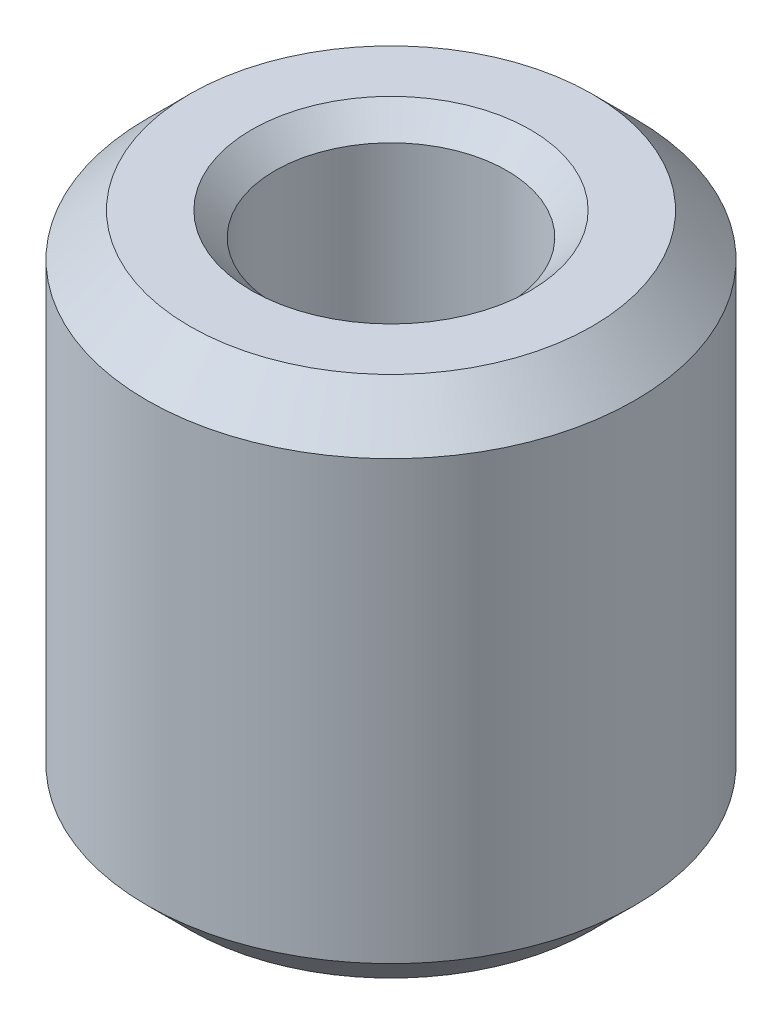
ISO-10303-21;
HEADER;
FILE_DESCRIPTION(('STEP AP214'),'2;1');
FILE_NAME('part.step','',(''),(''),'','','');
FILE_SCHEMA(('AUTOMOTIVE_DESIGN { 1 0 10303 214 1 1 1 1 }'));
ENDSEC;
DATA;
#1=APPLICATION_CONTEXT('core data for automotive mechanical design processes');
#2=APPLICATION_PROTOCOL_DEFINITION('international standard','automotive_design',2000,#1);
#3=PRODUCT_CONTEXT('',#1,'mechanical');
#4=PRODUCT('Part','Part','',(#3));
#5=PRODUCT_RELATED_PRODUCT_CATEGORY('part','',(#4));
#6=PRODUCT_DEFINITION_FORMATION('','',#4);
#7=PRODUCT_DEFINITION_CONTEXT('part definition',#1,'design');
#8=PRODUCT_DEFINITION('design','',#6,#7);
#9=PRODUCT_DEFINITION_SHAPE('','',#8);
#10=(LENGTH_UNIT() NAMED_UNIT(*) SI_UNIT(.MILLI.,.METRE.));
#11=(NAMED_UNIT(*) PLANE_ANGLE_UNIT() SI_UNIT($,.RADIAN.));
#12=(NAMED_UNIT(*) SI_UNIT($,.STERADIAN.) SOLID_ANGLE_UNIT());
#13=UNCERTAINTY_MEASURE_WITH_UNIT(LENGTH_MEASURE(1.E-05),#10,'distance_accuracy_value','');
#14=(GEOMETRIC_REPRESENTATION_CONTEXT(3) GLOBAL_UNCERTAINTY_ASSIGNED_CONTEXT((#13)) GLOBAL_UNIT_ASSIGNED_CONTEXT((#10,
#11,#12)) REPRESENTATION_CONTEXT('',''));
#15=CARTESIAN_POINT('',(0.,0.,0.));
#16=DIRECTION('',(0.,0.,1.));
#17=DIRECTION('',(1.,0.,0.));
#18=AXIS2_PLACEMENT_3D('',#15,#16,#17);
#19=CARTESIAN_POINT('',(0.,0.,0.));
#20=DIRECTION('',(0.,-1.,0.));
#21=DIRECTION('',(1.,0.,0.));
#22=AXIS2_PLACEMENT_3D('',#19,#20,#21);
#23=CYLINDRICAL_SURFACE('',#22,3.3235);
#24=CARTESIAN_POINT('',(0.,-14.3234999999891,0.));
#25=DIRECTION('',(0.,-1.,0.));
#26=DIRECTION('',(1.,0.,0.));
#27=AXIS2_PLACEMENT_3D('',#24,#25,#26);
#28=CIRCLE('',#27,3.3234999999649);
#29=CARTESIAN_POINT('',(3.32349999996495,-14.3234999999891,0.));
#30=VERTEX_POINT('',#29);
#31=EDGE_CURVE('E34',#30,#30,#28,.T.);
#32=ORIENTED_EDGE('',*,*,#31,.T.);
#33=EDGE_LOOP('',(#32));
#34=FACE_BOUND('',#33,.T.);
#35=CARTESIAN_POINT('',(0.,-0.676499999997293,0.));
#36=DIRECTION('',(0.,1.,0.));
#37=DIRECTION('',(-1.,0.,0.));
#38=AXIS2_PLACEMENT_3D('',#35,#36,#37);
#39=CIRCLE('',#38,3.32349999996495);
#40=CARTESIAN_POINT('',(-3.32349999996495,-0.676499999997304,0.));
#41=VERTEX_POINT('',#40);
#42=EDGE_CURVE('E37',#41,#41,#39,.T.);
#43=ORIENTED_EDGE('',*,*,#42,.T.);
#44=EDGE_LOOP('',(#43));
#45=FACE_BOUND('',#44,.T.);
#46=ADVANCED_FACE('F15',(#34,#45),#23,.F.);
#47=CARTESIAN_POINT('',(0.,0.,0.));
#48=DIRECTION('',(0.,1.,0.));
#49=DIRECTION('',(-1.,0.,0.));
#50=AXIS2_PLACEMENT_3D('',#47,#48,#49);
#51=CONICAL_SURFACE('',#50,4.0000000000191,0.785398163439458);
#52=CARTESIAN_POINT('',(0.,0.,0.));
#53=DIRECTION('',(0.,1.,0.));
#54=DIRECTION('',(-1.,0.,0.));
#55=AXIS2_PLACEMENT_3D('',#52,#53,#54);
#56=CIRCLE('',#55,4.0000000000191);
#57=CARTESIAN_POINT('',(-4.0000000000191,0.,0.));
#58=VERTEX_POINT('',#57);
#59=EDGE_CURVE('E18',#58,#58,#56,.T.);
#60=ORIENTED_EDGE('',*,*,#59,.T.);
#61=EDGE_LOOP('',(#60));
#62=FACE_BOUND('',#61,.T.);
#63=ORIENTED_EDGE('',*,*,#42,.F.);
#64=EDGE_LOOP('',(#63));
#65=FACE_BOUND('',#64,.T.);
#66=ADVANCED_FACE('F55',(#62,#65),#51,.F.);
#67=CARTESIAN_POINT('',(0.,-15.0000000000432,0.));
#68=DIRECTION('',(0.,-1.,0.));
#69=DIRECTION('',(1.,0.,0.));
#70=AXIS2_PLACEMENT_3D('',#67,#68,#69);
#71=CONICAL_SURFACE('',#70,4.00000000001905,0.785398163397446);
#72=CARTESIAN_POINT('',(0.,-15.0000000000432,0.));
#73=DIRECTION('',(0.,-1.,0.));
#74=DIRECTION('',(1.,0.,0.));
#75=AXIS2_PLACEMENT_3D('',#72,#73,#74);
#76=CIRCLE('',#75,4.00000000001905);
#77=CARTESIAN_POINT('',(4.0000000000191,-15.0000000000432,0.));
#78=VERTEX_POINT('',#77);
#79=EDGE_CURVE('E48',#78,#78,#76,.T.);
#80=ORIENTED_EDGE('',*,*,#79,.T.);
#81=EDGE_LOOP('',(#80));
#82=FACE_BOUND('',#81,.T.);
#83=ORIENTED_EDGE('',*,*,#31,.F.);
#84=EDGE_LOOP('',(#83));
#85=FACE_BOUND('',#84,.T.);
#86=ADVANCED_FACE('F62',(#82,#85),#71,.F.);
#87=CARTESIAN_POINT('',(-4.,0.,0.));
#88=DIRECTION('',(0.,-1.,0.));
#89=DIRECTION('',(1.,0.,0.));
#90=AXIS2_PLACEMENT_3D('',#87,#88,#89);
#91=PLANE('',#90);
#92=ORIENTED_EDGE('',*,*,#59,.F.);
#93=EDGE_LOOP('',(#92));
#94=FACE_BOUND('',#93,.T.);
#95=CARTESIAN_POINT('',(0.,0.,0.));
#96=DIRECTION('',(0.,-1.,0.));
#97=DIRECTION('',(1.,0.,0.));
#98=AXIS2_PLACEMENT_3D('',#95,#96,#97);
#99=CIRCLE('',#98,5.77299999991965);
#100=CARTESIAN_POINT('',(5.77299999991965,0.,0.));
#101=VERTEX_POINT('',#100);
#102=EDGE_CURVE('E46',#101,#101,#99,.T.);
#103=ORIENTED_EDGE('',*,*,#102,.F.);
#104=EDGE_LOOP('',(#103));
#105=FACE_BOUND('',#104,.T.);
#106=ADVANCED_FACE('F58',(#94,#105),#91,.F.);
#107=CARTESIAN_POINT('',(-5.77299999999995,-15.,0.));
#108=DIRECTION('',(0.,1.,0.));
#109=DIRECTION('',(-1.,0.,0.));
#110=AXIS2_PLACEMENT_3D('',#107,#108,#109);
#111=PLANE('',#110);
#112=ORIENTED_EDGE('',*,*,#79,.F.);
#113=EDGE_LOOP('',(#112));
#114=FACE_BOUND('',#113,.T.);
#115=CARTESIAN_POINT('',(0.,-15.,0.));
#116=DIRECTION('',(0.,1.,0.));
#117=DIRECTION('',(-1.,0.,0.));
#118=AXIS2_PLACEMENT_3D('',#115,#116,#117);
#119=CIRCLE('',#118,5.77300000000001);
#120=CARTESIAN_POINT('',(-5.77299999999996,-15.,0.));
#121=VERTEX_POINT('',#120);
#122=EDGE_CURVE('E27',#121,#121,#119,.T.);
#123=ORIENTED_EDGE('',*,*,#122,.F.);
#124=EDGE_LOOP('',(#123));
#125=FACE_BOUND('',#124,.T.);
#126=ADVANCED_FACE('F61',(#114,#125),#111,.F.);
#127=CARTESIAN_POINT('',(0.,-1.22700000008538,0.));
#128=DIRECTION('',(0.,-1.,0.));
#129=DIRECTION('',(1.,0.,0.));
#130=AXIS2_PLACEMENT_3D('',#127,#128,#129);
#131=CONICAL_SURFACE('',#130,7.000000000005,0.785398163397445);
#132=CARTESIAN_POINT('',(0.,-1.227,0.));
#133=DIRECTION('',(0.,-1.,0.));
#134=DIRECTION('',(1.,0.,0.));
#135=AXIS2_PLACEMENT_3D('',#132,#133,#134);
#136=CIRCLE('',#135,7.);
#137=CARTESIAN_POINT('',(7.,-1.22699999999998,0.));
#138=VERTEX_POINT('',#137);
#139=EDGE_CURVE('E22',#138,#138,#136,.T.);
#140=ORIENTED_EDGE('',*,*,#139,.F.);
#141=EDGE_LOOP('',(#140));
#142=FACE_BOUND('',#141,.T.);
#143=ORIENTED_EDGE('',*,*,#102,.T.);
#144=EDGE_LOOP('',(#143));
#145=FACE_BOUND('',#144,.T.);
#146=ADVANCED_FACE('F66',(#142,#145),#131,.T.);
#147=CARTESIAN_POINT('',(0.,-13.773,0.));
#148=DIRECTION('',(0.,1.,0.));
#149=DIRECTION('',(-1.,0.,0.));
#150=AXIS2_PLACEMENT_3D('',#147,#148,#149);
#151=CONICAL_SURFACE('',#150,7.00000000000001,0.785398163397449);
#152=CARTESIAN_POINT('',(0.,-13.773,0.));
#153=DIRECTION('',(0.,-1.,0.));
#154=DIRECTION('',(1.,0.,0.));
#155=AXIS2_PLACEMENT_3D('',#152,#153,#154);
#156=CIRCLE('',#155,7.);
#157=CARTESIAN_POINT('',(7.00000000000005,-13.773,0.));
#158=VERTEX_POINT('',#157);
#159=EDGE_CURVE('E10',#158,#158,#156,.F.);
#160=ORIENTED_EDGE('',*,*,#159,.F.);
#161=EDGE_LOOP('',(#160));
#162=FACE_BOUND('',#161,.T.);
#163=ORIENTED_EDGE('',*,*,#122,.T.);
#164=EDGE_LOOP('',(#163));
#165=FACE_BOUND('',#164,.T.);
#166=ADVANCED_FACE('F68',(#162,#165),#151,.T.);
#167=CARTESIAN_POINT('',(0.,0.,0.));
#168=DIRECTION('',(0.,-1.,0.));
#169=DIRECTION('',(1.,0.,0.));
#170=AXIS2_PLACEMENT_3D('',#167,#168,#169);
#171=CYLINDRICAL_SURFACE('',#170,7.);
#172=ORIENTED_EDGE('',*,*,#159,.T.);
#173=EDGE_LOOP('',(#172));
#174=FACE_BOUND('',#173,.T.);
#175=ORIENTED_EDGE('',*,*,#139,.T.);
#176=EDGE_LOOP('',(#175));
#177=FACE_BOUND('',#176,.T.);
#178=ADVANCED_FACE('F76',(#174,#177),#171,.T.);
#179=CLOSED_SHELL('',(#46,#66,#86,#106,#126,#146,#166,#178));
#180=MANIFOLD_SOLID_BREP('B1',#179);
#181=ADVANCED_BREP_SHAPE_REPRESENTATION('',(#18,#180),#14);
#182=SHAPE_DEFINITION_REPRESENTATION(#9,#181);
ENDSEC;
END-ISO-10303-21;
